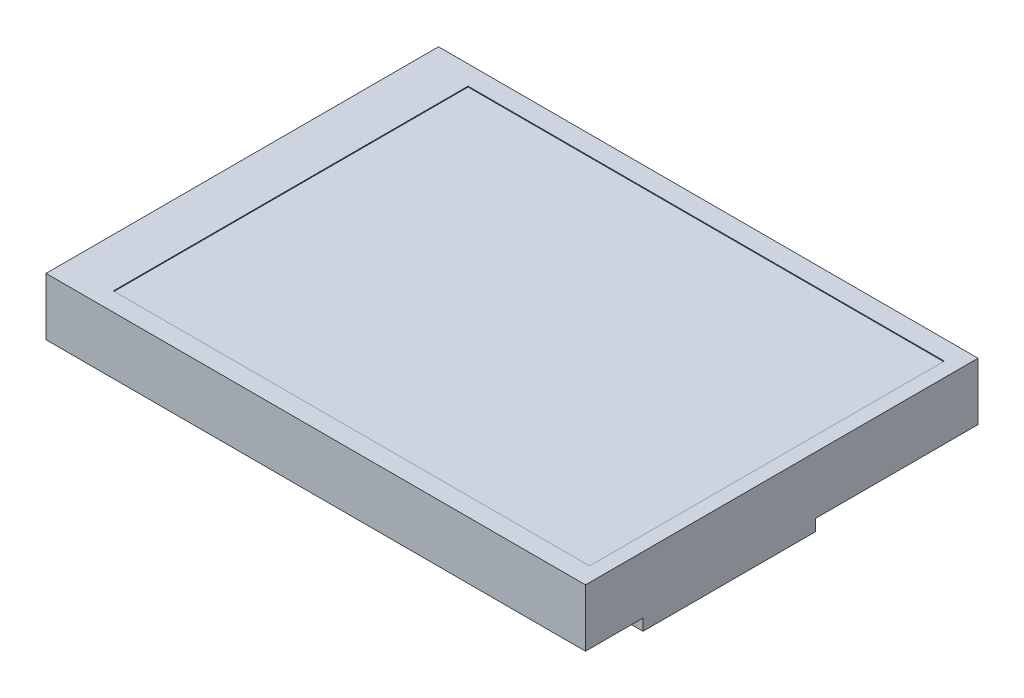
ISO-10303-21;
HEADER;
FILE_DESCRIPTION(('STEP AP214'),'2;1');
FILE_NAME('part.step','',(''),(''),'','','');
FILE_SCHEMA(('AUTOMOTIVE_DESIGN { 1 0 10303 214 1 1 1 1 }'));
ENDSEC;
DATA;
#1=APPLICATION_CONTEXT('core data for automotive mechanical design processes');
#2=APPLICATION_PROTOCOL_DEFINITION('international standard','automotive_design',2000,#1);
#3=PRODUCT_CONTEXT('',#1,'mechanical');
#4=PRODUCT('Part','Part','',(#3));
#5=PRODUCT_RELATED_PRODUCT_CATEGORY('part','',(#4));
#6=PRODUCT_DEFINITION_FORMATION('','',#4);
#7=PRODUCT_DEFINITION_CONTEXT('part definition',#1,'design');
#8=PRODUCT_DEFINITION('design','',#6,#7);
#9=PRODUCT_DEFINITION_SHAPE('','',#8);
#10=(LENGTH_UNIT() NAMED_UNIT(*) SI_UNIT(.MILLI.,.METRE.));
#11=(NAMED_UNIT(*) PLANE_ANGLE_UNIT() SI_UNIT($,.RADIAN.));
#12=(NAMED_UNIT(*) SI_UNIT($,.STERADIAN.) SOLID_ANGLE_UNIT());
#13=UNCERTAINTY_MEASURE_WITH_UNIT(LENGTH_MEASURE(1.E-05),#10,'distance_accuracy_value','');
#14=(GEOMETRIC_REPRESENTATION_CONTEXT(3) GLOBAL_UNCERTAINTY_ASSIGNED_CONTEXT((#13)) GLOBAL_UNIT_ASSIGNED_CONTEXT((#10,
#11,#12)) REPRESENTATION_CONTEXT('',''));
#15=CARTESIAN_POINT('',(0.,0.,0.));
#16=DIRECTION('',(0.,0.,1.));
#17=DIRECTION('',(1.,0.,0.));
#18=AXIS2_PLACEMENT_3D('',#15,#16,#17);
#19=CARTESIAN_POINT('',(0.,0.,0.));
#20=DIRECTION('',(0.,-1.,0.));
#21=DIRECTION('',(0.,0.,-1.));
#22=AXIS2_PLACEMENT_3D('',#19,#20,#21);
#23=PLANE('',#22);
#24=DIRECTION('',(-1.,0.,0.));
#25=VECTOR('',#24,1.);
#26=CARTESIAN_POINT('',(52.7,0.,-7.));
#27=LINE('',#26,#25);
#28=CARTESIAN_POINT('',(65.7,0.,-7.));
#29=VERTEX_POINT('',#28);
#30=CARTESIAN_POINT('',(52.7,0.,-7.));
#31=VERTEX_POINT('',#30);
#32=EDGE_CURVE('E287',#29,#31,#27,.T.);
#33=ORIENTED_EDGE('',*,*,#32,.F.);
#34=DIRECTION('',(0.,0.,-1.));
#35=VECTOR('',#34,1.);
#36=CARTESIAN_POINT('',(65.7,0.,0.));
#37=LINE('',#36,#35);
#38=CARTESIAN_POINT('',(65.7,0.,0.));
#39=VERTEX_POINT('',#38);
#40=EDGE_CURVE('E361',#39,#29,#37,.T.);
#41=ORIENTED_EDGE('',*,*,#40,.F.);
#42=DIRECTION('',(1.,0.,0.));
#43=VECTOR('',#42,1.);
#44=CARTESIAN_POINT('',(0.,0.,0.));
#45=LINE('',#44,#43);
#46=CARTESIAN_POINT('',(0.,0.,0.));
#47=VERTEX_POINT('',#46);
#48=EDGE_CURVE('E358',#47,#39,#45,.T.);
#49=ORIENTED_EDGE('',*,*,#48,.F.);
#50=DIRECTION('',(0.,0.,1.));
#51=VECTOR('',#50,1.);
#52=CARTESIAN_POINT('',(0.,0.,0.));
#53=LINE('',#52,#51);
#54=CARTESIAN_POINT('',(0.,0.,-47.8));
#55=VERTEX_POINT('',#54);
#56=EDGE_CURVE('E338',#55,#47,#53,.T.);
#57=ORIENTED_EDGE('',*,*,#56,.F.);
#58=DIRECTION('',(-1.,0.,0.));
#59=VECTOR('',#58,1.);
#60=CARTESIAN_POINT('',(0.,0.,-47.8));
#61=LINE('',#60,#59);
#62=CARTESIAN_POINT('',(65.7,0.,-47.8));
#63=VERTEX_POINT('',#62);
#64=EDGE_CURVE('E349',#63,#55,#61,.T.);
#65=ORIENTED_EDGE('',*,*,#64,.F.);
#66=CARTESIAN_POINT('',(65.7,0.,-28.));
#67=VERTEX_POINT('',#66);
#68=EDGE_CURVE('E360',#67,#63,#37,.T.);
#69=ORIENTED_EDGE('',*,*,#68,.F.);
#70=DIRECTION('',(1.,0.,0.));
#71=VECTOR('',#70,1.);
#72=CARTESIAN_POINT('',(52.7,0.,-28.));
#73=LINE('',#72,#71);
#74=CARTESIAN_POINT('',(52.7,0.,-28.));
#75=VERTEX_POINT('',#74);
#76=EDGE_CURVE('E296',#75,#67,#73,.T.);
#77=ORIENTED_EDGE('',*,*,#76,.F.);
#78=DIRECTION('',(0.,0.,-1.));
#79=VECTOR('',#78,1.);
#80=CARTESIAN_POINT('',(52.7,0.,-7.));
#81=LINE('',#80,#79);
#82=EDGE_CURVE('E282',#31,#75,#81,.T.);
#83=ORIENTED_EDGE('',*,*,#82,.F.);
#84=EDGE_LOOP('',(#33,#41,#49,#57,#65,#69,#77,#83));
#85=FACE_BOUND('',#84,.T.);
#86=DIRECTION('',(1.,0.,0.));
#87=VECTOR('',#86,1.);
#88=CARTESIAN_POINT('',(25.,0.,-12.));
#89=LINE('',#88,#87);
#90=CARTESIAN_POINT('',(25.,0.,-12.));
#91=VERTEX_POINT('',#90);
#92=CARTESIAN_POINT('',(30.5,0.,-12.));
#93=VERTEX_POINT('',#92);
#94=EDGE_CURVE('E267',#91,#93,#89,.T.);
#95=ORIENTED_EDGE('',*,*,#94,.F.);
#96=DIRECTION('',(0.,0.,-1.));
#97=VECTOR('',#96,1.);
#98=CARTESIAN_POINT('',(25.,0.,-3.5));
#99=LINE('',#98,#97);
#100=CARTESIAN_POINT('',(25.,0.,-3.5));
#101=VERTEX_POINT('',#100);
#102=EDGE_CURVE('E253',#101,#91,#99,.T.);
#103=ORIENTED_EDGE('',*,*,#102,.F.);
#104=DIRECTION('',(-1.,0.,0.));
#105=VECTOR('',#104,1.);
#106=CARTESIAN_POINT('',(25.,0.,-3.5));
#107=LINE('',#106,#105);
#108=CARTESIAN_POINT('',(30.5,0.,-3.5));
#109=VERTEX_POINT('',#108);
#110=EDGE_CURVE('E258',#109,#101,#107,.T.);
#111=ORIENTED_EDGE('',*,*,#110,.F.);
#112=DIRECTION('',(0.,0.,1.));
#113=VECTOR('',#112,1.);
#114=CARTESIAN_POINT('',(30.5,0.,-3.5));
#115=LINE('',#114,#113);
#116=EDGE_CURVE('E269',#93,#109,#115,.T.);
#117=ORIENTED_EDGE('',*,*,#116,.F.);
#118=EDGE_LOOP('',(#95,#103,#111,#117));
#119=FACE_BOUND('',#118,.T.);
#120=DIRECTION('',(-1.,0.,0.));
#121=VECTOR('',#120,1.);
#122=CARTESIAN_POINT('',(29.7,0.,-16.));
#123=LINE('',#122,#121);
#124=CARTESIAN_POINT('',(29.7,0.,-16.));
#125=VERTEX_POINT('',#124);
#126=CARTESIAN_POINT('',(25.7,0.,-16.));
#127=VERTEX_POINT('',#126);
#128=EDGE_CURVE('E225',#125,#127,#123,.T.);
#129=ORIENTED_EDGE('',*,*,#128,.F.);
#130=DIRECTION('',(0.,0.,1.));
#131=VECTOR('',#130,1.);
#132=CARTESIAN_POINT('',(29.7,0.,-16.));
#133=LINE('',#132,#131);
#134=CARTESIAN_POINT('',(29.7,0.,-31.));
#135=VERTEX_POINT('',#134);
#136=EDGE_CURVE('E222',#135,#125,#133,.T.);
#137=ORIENTED_EDGE('',*,*,#136,.F.);
#138=DIRECTION('',(1.,0.,0.));
#139=VECTOR('',#138,1.);
#140=CARTESIAN_POINT('',(29.7,0.,-31.));
#141=LINE('',#140,#139);
#142=CARTESIAN_POINT('',(25.7,0.,-31.));
#143=VERTEX_POINT('',#142);
#144=EDGE_CURVE('E234',#143,#135,#141,.T.);
#145=ORIENTED_EDGE('',*,*,#144,.F.);
#146=DIRECTION('',(0.,0.,-1.));
#147=VECTOR('',#146,1.);
#148=CARTESIAN_POINT('',(25.7,0.,-16.));
#149=LINE('',#148,#147);
#150=EDGE_CURVE('E242',#127,#143,#149,.T.);
#151=ORIENTED_EDGE('',*,*,#150,.F.);
#152=EDGE_LOOP('',(#129,#137,#145,#151));
#153=FACE_BOUND('',#152,.T.);
#154=DIRECTION('',(1.,0.,0.));
#155=VECTOR('',#154,1.);
#156=CARTESIAN_POINT('',(7.70000000000001,0.,-46.3));
#157=LINE('',#156,#155);
#158=CARTESIAN_POINT('',(7.70000000000001,0.,-46.3));
#159=VERTEX_POINT('',#158);
#160=CARTESIAN_POINT('',(58.7,0.,-46.3));
#161=VERTEX_POINT('',#160);
#162=EDGE_CURVE('E665',#159,#161,#157,.T.);
#163=ORIENTED_EDGE('',*,*,#162,.F.);
#164=DIRECTION('',(0.,0.,-1.));
#165=VECTOR('',#164,1.);
#166=CARTESIAN_POINT('',(7.70000000000001,0.,-41.3));
#167=LINE('',#166,#165);
#168=CARTESIAN_POINT('',(7.70000000000001,0.,-41.3));
#169=VERTEX_POINT('',#168);
#170=EDGE_CURVE('E220',#169,#159,#167,.T.);
#171=ORIENTED_EDGE('',*,*,#170,.F.);
#172=DIRECTION('',(-1.,0.,0.));
#173=VECTOR('',#172,1.);
#174=CARTESIAN_POINT('',(7.70000000000001,0.,-41.3));
#175=LINE('',#174,#173);
#176=CARTESIAN_POINT('',(58.7,0.,-41.3));
#177=VERTEX_POINT('',#176);
#178=EDGE_CURVE('E216',#177,#169,#175,.T.);
#179=ORIENTED_EDGE('',*,*,#178,.F.);
#180=DIRECTION('',(0.,0.,1.));
#181=VECTOR('',#180,1.);
#182=CARTESIAN_POINT('',(58.7,0.,-41.3));
#183=LINE('',#182,#181);
#184=EDGE_CURVE('E662',#161,#177,#183,.T.);
#185=ORIENTED_EDGE('',*,*,#184,.F.);
#186=EDGE_LOOP('',(#163,#171,#179,#185));
#187=FACE_BOUND('',#186,.T.);
#188=ADVANCED_FACE('F35',(#85,#119,#153,#187),#23,.T.);
#189=CARTESIAN_POINT('',(0.,7.,0.));
#190=DIRECTION('',(1.,0.,0.));
#191=DIRECTION('',(0.,0.,-1.));
#192=AXIS2_PLACEMENT_3D('',#189,#190,#191);
#193=PLANE('',#192);
#194=ORIENTED_EDGE('',*,*,#56,.T.);
#195=DIRECTION('',(0.,-1.,0.));
#196=VECTOR('',#195,1.);
#197=CARTESIAN_POINT('',(0.,7.,0.));
#198=LINE('',#197,#196);
#199=CARTESIAN_POINT('',(0.,7.,0.));
#200=VERTEX_POINT('',#199);
#201=EDGE_CURVE('E11',#200,#47,#198,.T.);
#202=ORIENTED_EDGE('',*,*,#201,.F.);
#203=DIRECTION('',(0.,0.,1.));
#204=VECTOR('',#203,1.);
#205=CARTESIAN_POINT('',(0.,7.,0.));
#206=LINE('',#205,#204);
#207=CARTESIAN_POINT('',(0.,7.,-47.8));
#208=VERTEX_POINT('',#207);
#209=EDGE_CURVE('E345',#208,#200,#206,.T.);
#210=ORIENTED_EDGE('',*,*,#209,.F.);
#211=DIRECTION('',(0.,-1.,0.));
#212=VECTOR('',#211,1.);
#213=CARTESIAN_POINT('',(0.,7.,-47.8));
#214=LINE('',#213,#212);
#215=EDGE_CURVE('E355',#208,#55,#214,.T.);
#216=ORIENTED_EDGE('',*,*,#215,.T.);
#217=EDGE_LOOP('',(#194,#202,#210,#216));
#218=FACE_BOUND('',#217,.T.);
#219=ADVANCED_FACE('F37',(#218),#193,.F.);
#220=CARTESIAN_POINT('',(0.,7.,0.));
#221=DIRECTION('',(0.,0.,-1.));
#222=DIRECTION('',(-1.,0.,0.));
#223=AXIS2_PLACEMENT_3D('',#220,#221,#222);
#224=PLANE('',#223);
#225=ORIENTED_EDGE('',*,*,#48,.T.);
#226=DIRECTION('',(0.,-1.,0.));
#227=VECTOR('',#226,1.);
#228=CARTESIAN_POINT('',(65.7,7.,0.));
#229=LINE('',#228,#227);
#230=CARTESIAN_POINT('',(65.7,7.,0.));
#231=VERTEX_POINT('',#230);
#232=EDGE_CURVE('E43',#231,#39,#229,.T.);
#233=ORIENTED_EDGE('',*,*,#232,.F.);
#234=DIRECTION('',(1.,0.,0.));
#235=VECTOR('',#234,1.);
#236=CARTESIAN_POINT('',(0.,7.,0.));
#237=LINE('',#236,#235);
#238=EDGE_CURVE('E348',#200,#231,#237,.T.);
#239=ORIENTED_EDGE('',*,*,#238,.F.);
#240=ORIENTED_EDGE('',*,*,#201,.T.);
#241=EDGE_LOOP('',(#225,#233,#239,#240));
#242=FACE_BOUND('',#241,.T.);
#243=ADVANCED_FACE('F405',(#242),#224,.F.);
#244=CARTESIAN_POINT('',(65.7,7.,0.));
#245=DIRECTION('',(-1.,0.,0.));
#246=DIRECTION('',(0.,0.,1.));
#247=AXIS2_PLACEMENT_3D('',#244,#245,#246);
#248=PLANE('',#247);
#249=ORIENTED_EDGE('',*,*,#40,.T.);
#250=DIRECTION('',(0.,1.,0.));
#251=VECTOR('',#250,1.);
#252=CARTESIAN_POINT('',(65.7,-1.4,-7.));
#253=LINE('',#252,#251);
#254=CARTESIAN_POINT('',(65.7,-1.4,-7.));
#255=VERTEX_POINT('',#254);
#256=EDGE_CURVE('E303',#255,#29,#253,.T.);
#257=ORIENTED_EDGE('',*,*,#256,.F.);
#258=DIRECTION('',(0.,0.,1.));
#259=VECTOR('',#258,1.);
#260=CARTESIAN_POINT('',(65.7,-1.4,-7.));
#261=LINE('',#260,#259);
#262=CARTESIAN_POINT('',(65.7,-1.4,-28.));
#263=VERTEX_POINT('',#262);
#264=EDGE_CURVE('E289',#263,#255,#261,.T.);
#265=ORIENTED_EDGE('',*,*,#264,.F.);
#266=DIRECTION('',(0.,1.,0.));
#267=VECTOR('',#266,1.);
#268=CARTESIAN_POINT('',(65.7,-1.4,-28.));
#269=LINE('',#268,#267);
#270=EDGE_CURVE('E306',#263,#67,#269,.T.);
#271=ORIENTED_EDGE('',*,*,#270,.T.);
#272=ORIENTED_EDGE('',*,*,#68,.T.);
#273=DIRECTION('',(0.,-1.,0.));
#274=VECTOR('',#273,1.);
#275=CARTESIAN_POINT('',(65.7,7.,-47.8));
#276=LINE('',#275,#274);
#277=CARTESIAN_POINT('',(65.7,7.,-47.8));
#278=VERTEX_POINT('',#277);
#279=EDGE_CURVE('E367',#278,#63,#276,.T.);
#280=ORIENTED_EDGE('',*,*,#279,.F.);
#281=DIRECTION('',(0.,0.,-1.));
#282=VECTOR('',#281,1.);
#283=CARTESIAN_POINT('',(65.7,7.,0.));
#284=LINE('',#283,#282);
#285=EDGE_CURVE('E351',#231,#278,#284,.T.);
#286=ORIENTED_EDGE('',*,*,#285,.F.);
#287=ORIENTED_EDGE('',*,*,#232,.T.);
#288=EDGE_LOOP('',(#249,#257,#265,#271,#272,#280,#286,#287));
#289=FACE_BOUND('',#288,.T.);
#290=ADVANCED_FACE('F374',(#289),#248,.F.);
#291=CARTESIAN_POINT('',(0.,7.,-47.8));
#292=DIRECTION('',(0.,0.,1.));
#293=DIRECTION('',(1.,0.,0.));
#294=AXIS2_PLACEMENT_3D('',#291,#292,#293);
#295=PLANE('',#294);
#296=ORIENTED_EDGE('',*,*,#64,.T.);
#297=ORIENTED_EDGE('',*,*,#215,.F.);
#298=DIRECTION('',(-1.,0.,0.));
#299=VECTOR('',#298,1.);
#300=CARTESIAN_POINT('',(0.,7.,-47.8));
#301=LINE('',#300,#299);
#302=EDGE_CURVE('E353',#278,#208,#301,.T.);
#303=ORIENTED_EDGE('',*,*,#302,.F.);
#304=ORIENTED_EDGE('',*,*,#279,.T.);
#305=EDGE_LOOP('',(#296,#297,#303,#304));
#306=FACE_BOUND('',#305,.T.);
#307=ADVANCED_FACE('F398',(#306),#295,.F.);
#308=CARTESIAN_POINT('',(0.,7.,0.));
#309=DIRECTION('',(0.,-1.,0.));
#310=DIRECTION('',(0.,0.,-1.));
#311=AXIS2_PLACEMENT_3D('',#308,#309,#310);
#312=PLANE('',#311);
#313=DIRECTION('',(1.,0.,0.));
#314=VECTOR('',#313,1.);
#315=CARTESIAN_POINT('',(5.95000000000001,7.,-2.25));
#316=LINE('',#315,#314);
#317=CARTESIAN_POINT('',(5.95000000000001,7.,-2.25));
#318=VERTEX_POINT('',#317);
#319=CARTESIAN_POINT('',(63.95,7.,-2.25));
#320=VERTEX_POINT('',#319);
#321=EDGE_CURVE('E328',#318,#320,#316,.T.);
#322=ORIENTED_EDGE('',*,*,#321,.F.);
#323=DIRECTION('',(0.,0.,1.));
#324=VECTOR('',#323,1.);
#325=CARTESIAN_POINT('',(5.95,7.,-45.45));
#326=LINE('',#325,#324);
#327=CARTESIAN_POINT('',(5.95,7.,-45.45));
#328=VERTEX_POINT('',#327);
#329=EDGE_CURVE('E312',#328,#318,#326,.T.);
#330=ORIENTED_EDGE('',*,*,#329,.F.);
#331=DIRECTION('',(-1.,0.,0.));
#332=VECTOR('',#331,1.);
#333=CARTESIAN_POINT('',(5.95,7.,-45.45));
#334=LINE('',#333,#332);
#335=CARTESIAN_POINT('',(63.95,7.,-45.45));
#336=VERTEX_POINT('',#335);
#337=EDGE_CURVE('E317',#336,#328,#334,.T.);
#338=ORIENTED_EDGE('',*,*,#337,.F.);
#339=DIRECTION('',(0.,0.,-1.));
#340=VECTOR('',#339,1.);
#341=CARTESIAN_POINT('',(63.95,7.,-45.45));
#342=LINE('',#341,#340);
#343=EDGE_CURVE('E331',#320,#336,#342,.T.);
#344=ORIENTED_EDGE('',*,*,#343,.F.);
#345=EDGE_LOOP('',(#322,#330,#338,#344));
#346=FACE_BOUND('',#345,.T.);
#347=ORIENTED_EDGE('',*,*,#209,.T.);
#348=ORIENTED_EDGE('',*,*,#238,.T.);
#349=ORIENTED_EDGE('',*,*,#285,.T.);
#350=ORIENTED_EDGE('',*,*,#302,.T.);
#351=EDGE_LOOP('',(#347,#348,#349,#350));
#352=FACE_BOUND('',#351,.T.);
#353=ADVANCED_FACE('F404',(#346,#352),#312,.F.);
#354=CARTESIAN_POINT('',(5.95,6.9,-45.45));
#355=DIRECTION('',(-1.,0.,0.));
#356=DIRECTION('',(0.,0.,1.));
#357=AXIS2_PLACEMENT_3D('',#354,#355,#356);
#358=PLANE('',#357);
#359=ORIENTED_EDGE('',*,*,#329,.T.);
#360=DIRECTION('',(0.,1.,0.));
#361=VECTOR('',#360,1.);
#362=CARTESIAN_POINT('',(5.95000000000001,6.9,-2.25));
#363=LINE('',#362,#361);
#364=CARTESIAN_POINT('',(5.95000000000001,6.9,-2.25));
#365=VERTEX_POINT('',#364);
#366=EDGE_CURVE('E326',#365,#318,#363,.T.);
#367=ORIENTED_EDGE('',*,*,#366,.F.);
#368=DIRECTION('',(0.,0.,1.));
#369=VECTOR('',#368,1.);
#370=CARTESIAN_POINT('',(5.95,6.9,-45.45));
#371=LINE('',#370,#369);
#372=CARTESIAN_POINT('',(5.95,6.9,-45.45));
#373=VERTEX_POINT('',#372);
#374=EDGE_CURVE('E313',#373,#365,#371,.T.);
#375=ORIENTED_EDGE('',*,*,#374,.F.);
#376=DIRECTION('',(0.,1.,0.));
#377=VECTOR('',#376,1.);
#378=CARTESIAN_POINT('',(5.95,6.9,-45.45));
#379=LINE('',#378,#377);
#380=EDGE_CURVE('E336',#373,#328,#379,.T.);
#381=ORIENTED_EDGE('',*,*,#380,.T.);
#382=EDGE_LOOP('',(#359,#367,#375,#381));
#383=FACE_BOUND('',#382,.T.);
#384=ADVANCED_FACE('F423',(#383),#358,.F.);
#385=CARTESIAN_POINT('',(5.95,6.9,-45.45));
#386=DIRECTION('',(0.,0.,-1.));
#387=DIRECTION('',(-1.,0.,0.));
#388=AXIS2_PLACEMENT_3D('',#385,#386,#387);
#389=PLANE('',#388);
#390=ORIENTED_EDGE('',*,*,#337,.T.);
#391=ORIENTED_EDGE('',*,*,#380,.F.);
#392=DIRECTION('',(-1.,0.,0.));
#393=VECTOR('',#392,1.);
#394=CARTESIAN_POINT('',(5.95,6.9,-45.45));
#395=LINE('',#394,#393);
#396=CARTESIAN_POINT('',(63.95,6.9,-45.45));
#397=VERTEX_POINT('',#396);
#398=EDGE_CURVE('E323',#397,#373,#395,.T.);
#399=ORIENTED_EDGE('',*,*,#398,.F.);
#400=DIRECTION('',(0.,1.,0.));
#401=VECTOR('',#400,1.);
#402=CARTESIAN_POINT('',(63.95,6.9,-45.45));
#403=LINE('',#402,#401);
#404=EDGE_CURVE('E339',#397,#336,#403,.T.);
#405=ORIENTED_EDGE('',*,*,#404,.T.);
#406=EDGE_LOOP('',(#390,#391,#399,#405));
#407=FACE_BOUND('',#406,.T.);
#408=ADVANCED_FACE('F428',(#407),#389,.F.);
#409=CARTESIAN_POINT('',(63.95,6.9,-45.45));
#410=DIRECTION('',(1.,0.,0.));
#411=DIRECTION('',(0.,0.,-1.));
#412=AXIS2_PLACEMENT_3D('',#409,#410,#411);
#413=PLANE('',#412);
#414=ORIENTED_EDGE('',*,*,#343,.T.);
#415=ORIENTED_EDGE('',*,*,#404,.F.);
#416=DIRECTION('',(0.,0.,-1.));
#417=VECTOR('',#416,1.);
#418=CARTESIAN_POINT('',(63.95,6.9,-45.45));
#419=LINE('',#418,#417);
#420=CARTESIAN_POINT('',(63.95,6.9,-2.25));
#421=VERTEX_POINT('',#420);
#422=EDGE_CURVE('E320',#421,#397,#419,.T.);
#423=ORIENTED_EDGE('',*,*,#422,.F.);
#424=DIRECTION('',(0.,1.,0.));
#425=VECTOR('',#424,1.);
#426=CARTESIAN_POINT('',(63.95,6.9,-2.25));
#427=LINE('',#426,#425);
#428=EDGE_CURVE('E341',#421,#320,#427,.T.);
#429=ORIENTED_EDGE('',*,*,#428,.T.);
#430=EDGE_LOOP('',(#414,#415,#423,#429));
#431=FACE_BOUND('',#430,.T.);
#432=ADVANCED_FACE('F442',(#431),#413,.F.);
#433=CARTESIAN_POINT('',(5.95000000000001,6.9,-2.25));
#434=DIRECTION('',(0.,0.,1.));
#435=DIRECTION('',(1.,0.,0.));
#436=AXIS2_PLACEMENT_3D('',#433,#434,#435);
#437=PLANE('',#436);
#438=ORIENTED_EDGE('',*,*,#321,.T.);
#439=ORIENTED_EDGE('',*,*,#428,.F.);
#440=DIRECTION('',(1.,0.,0.));
#441=VECTOR('',#440,1.);
#442=CARTESIAN_POINT('',(5.95000000000001,6.9,-2.25));
#443=LINE('',#442,#441);
#444=EDGE_CURVE('E316',#365,#421,#443,.T.);
#445=ORIENTED_EDGE('',*,*,#444,.F.);
#446=ORIENTED_EDGE('',*,*,#366,.T.);
#447=EDGE_LOOP('',(#438,#439,#445,#446));
#448=FACE_BOUND('',#447,.T.);
#449=ADVANCED_FACE('F435',(#448),#437,.F.);
#450=CARTESIAN_POINT('',(0.,6.9,0.));
#451=DIRECTION('',(0.,1.,0.));
#452=DIRECTION('',(0.,0.,1.));
#453=AXIS2_PLACEMENT_3D('',#450,#451,#452);
#454=PLANE('',#453);
#455=ORIENTED_EDGE('',*,*,#374,.T.);
#456=ORIENTED_EDGE('',*,*,#444,.T.);
#457=ORIENTED_EDGE('',*,*,#422,.T.);
#458=ORIENTED_EDGE('',*,*,#398,.T.);
#459=EDGE_LOOP('',(#455,#456,#457,#458));
#460=FACE_BOUND('',#459,.T.);
#461=ADVANCED_FACE('F444',(#460),#454,.T.);
#462=CARTESIAN_POINT('',(52.7,-1.4,-7.));
#463=DIRECTION('',(1.,0.,0.));
#464=DIRECTION('',(0.,0.,-1.));
#465=AXIS2_PLACEMENT_3D('',#462,#463,#464);
#466=PLANE('',#465);
#467=ORIENTED_EDGE('',*,*,#82,.T.);
#468=DIRECTION('',(0.,1.,0.));
#469=VECTOR('',#468,1.);
#470=CARTESIAN_POINT('',(52.7,-1.4,-28.));
#471=LINE('',#470,#469);
#472=CARTESIAN_POINT('',(52.7,-1.4,-28.));
#473=VERTEX_POINT('',#472);
#474=EDGE_CURVE('E309',#473,#75,#471,.T.);
#475=ORIENTED_EDGE('',*,*,#474,.F.);
#476=DIRECTION('',(0.,0.,-1.));
#477=VECTOR('',#476,1.);
#478=CARTESIAN_POINT('',(52.7,-1.4,-7.));
#479=LINE('',#478,#477);
#480=CARTESIAN_POINT('',(52.7,-1.4,-7.));
#481=VERTEX_POINT('',#480);
#482=EDGE_CURVE('E283',#481,#473,#479,.T.);
#483=ORIENTED_EDGE('',*,*,#482,.F.);
#484=DIRECTION('',(0.,1.,0.));
#485=VECTOR('',#484,1.);
#486=CARTESIAN_POINT('',(52.7,-1.4,-7.));
#487=LINE('',#486,#485);
#488=EDGE_CURVE('E293',#481,#31,#487,.T.);
#489=ORIENTED_EDGE('',*,*,#488,.T.);
#490=EDGE_LOOP('',(#467,#475,#483,#489));
#491=FACE_BOUND('',#490,.T.);
#492=ADVANCED_FACE('F387',(#491),#466,.F.);
#493=CARTESIAN_POINT('',(52.7,-1.4,-28.));
#494=DIRECTION('',(0.,0.,1.));
#495=DIRECTION('',(1.,0.,0.));
#496=AXIS2_PLACEMENT_3D('',#493,#494,#495);
#497=PLANE('',#496);
#498=ORIENTED_EDGE('',*,*,#76,.T.);
#499=ORIENTED_EDGE('',*,*,#270,.F.);
#500=DIRECTION('',(1.,0.,0.));
#501=VECTOR('',#500,1.);
#502=CARTESIAN_POINT('',(52.7,-1.4,-28.));
#503=LINE('',#502,#501);
#504=EDGE_CURVE('E286',#473,#263,#503,.T.);
#505=ORIENTED_EDGE('',*,*,#504,.F.);
#506=ORIENTED_EDGE('',*,*,#474,.T.);
#507=EDGE_LOOP('',(#498,#499,#505,#506));
#508=FACE_BOUND('',#507,.T.);
#509=ADVANCED_FACE('F394',(#508),#497,.F.);
#510=CARTESIAN_POINT('',(52.7,-1.4,-7.));
#511=DIRECTION('',(0.,0.,-1.));
#512=DIRECTION('',(-1.,0.,0.));
#513=AXIS2_PLACEMENT_3D('',#510,#511,#512);
#514=PLANE('',#513);
#515=ORIENTED_EDGE('',*,*,#32,.T.);
#516=ORIENTED_EDGE('',*,*,#488,.F.);
#517=DIRECTION('',(-1.,0.,0.));
#518=VECTOR('',#517,1.);
#519=CARTESIAN_POINT('',(52.7,-1.4,-7.));
#520=LINE('',#519,#518);
#521=EDGE_CURVE('E291',#255,#481,#520,.T.);
#522=ORIENTED_EDGE('',*,*,#521,.F.);
#523=ORIENTED_EDGE('',*,*,#256,.T.);
#524=EDGE_LOOP('',(#515,#516,#522,#523));
#525=FACE_BOUND('',#524,.T.);
#526=ADVANCED_FACE('F383',(#525),#514,.F.);
#527=CARTESIAN_POINT('',(0.,-1.4,0.));
#528=DIRECTION('',(0.,-1.,0.));
#529=DIRECTION('',(0.,0.,-1.));
#530=AXIS2_PLACEMENT_3D('',#527,#528,#529);
#531=PLANE('',#530);
#532=ORIENTED_EDGE('',*,*,#482,.T.);
#533=ORIENTED_EDGE('',*,*,#504,.T.);
#534=ORIENTED_EDGE('',*,*,#264,.T.);
#535=ORIENTED_EDGE('',*,*,#521,.T.);
#536=EDGE_LOOP('',(#532,#533,#534,#535));
#537=FACE_BOUND('',#536,.T.);
#538=ADVANCED_FACE('F390',(#537),#531,.T.);
#539=CARTESIAN_POINT('',(25.,-2.1,-3.5));
#540=DIRECTION('',(1.,0.,0.));
#541=DIRECTION('',(0.,0.,-1.));
#542=AXIS2_PLACEMENT_3D('',#539,#540,#541);
#543=PLANE('',#542);
#544=ORIENTED_EDGE('',*,*,#102,.T.);
#545=DIRECTION('',(0.,1.,0.));
#546=VECTOR('',#545,1.);
#547=CARTESIAN_POINT('',(25.,-2.1,-12.));
#548=LINE('',#547,#546);
#549=CARTESIAN_POINT('',(25.,-2.1,-12.));
#550=VERTEX_POINT('',#549);
#551=EDGE_CURVE('E280',#550,#91,#548,.T.);
#552=ORIENTED_EDGE('',*,*,#551,.F.);
#553=DIRECTION('',(0.,0.,-1.));
#554=VECTOR('',#553,1.);
#555=CARTESIAN_POINT('',(25.,-2.1,-3.5));
#556=LINE('',#555,#554);
#557=CARTESIAN_POINT('',(25.,-2.1,-3.5));
#558=VERTEX_POINT('',#557);
#559=EDGE_CURVE('E254',#558,#550,#556,.T.);
#560=ORIENTED_EDGE('',*,*,#559,.F.);
#561=DIRECTION('',(0.,1.,0.));
#562=VECTOR('',#561,1.);
#563=CARTESIAN_POINT('',(25.,-2.1,-3.5));
#564=LINE('',#563,#562);
#565=EDGE_CURVE('E264',#558,#101,#564,.T.);
#566=ORIENTED_EDGE('',*,*,#565,.T.);
#567=EDGE_LOOP('',(#544,#552,#560,#566));
#568=FACE_BOUND('',#567,.T.);
#569=ADVANCED_FACE('F509',(#568),#543,.F.);
#570=CARTESIAN_POINT('',(25.,-2.1,-12.));
#571=DIRECTION('',(0.,0.,1.));
#572=DIRECTION('',(1.,0.,0.));
#573=AXIS2_PLACEMENT_3D('',#570,#571,#572);
#574=PLANE('',#573);
#575=ORIENTED_EDGE('',*,*,#94,.T.);
#576=DIRECTION('',(0.,1.,0.));
#577=VECTOR('',#576,1.);
#578=CARTESIAN_POINT('',(30.5,-2.1,-12.));
#579=LINE('',#578,#577);
#580=CARTESIAN_POINT('',(30.5,-2.1,-12.));
#581=VERTEX_POINT('',#580);
#582=EDGE_CURVE('E277',#581,#93,#579,.T.);
#583=ORIENTED_EDGE('',*,*,#582,.F.);
#584=DIRECTION('',(1.,0.,0.));
#585=VECTOR('',#584,1.);
#586=CARTESIAN_POINT('',(25.,-2.1,-12.));
#587=LINE('',#586,#585);
#588=EDGE_CURVE('E257',#550,#581,#587,.T.);
#589=ORIENTED_EDGE('',*,*,#588,.F.);
#590=ORIENTED_EDGE('',*,*,#551,.T.);
#591=EDGE_LOOP('',(#575,#583,#589,#590));
#592=FACE_BOUND('',#591,.T.);
#593=ADVANCED_FACE('F518',(#592),#574,.F.);
#594=CARTESIAN_POINT('',(30.5,-2.1,-3.5));
#595=DIRECTION('',(-1.,0.,0.));
#596=DIRECTION('',(0.,0.,1.));
#597=AXIS2_PLACEMENT_3D('',#594,#595,#596);
#598=PLANE('',#597);
#599=ORIENTED_EDGE('',*,*,#116,.T.);
#600=DIRECTION('',(0.,1.,0.));
#601=VECTOR('',#600,1.);
#602=CARTESIAN_POINT('',(30.5,-2.1,-3.5));
#603=LINE('',#602,#601);
#604=CARTESIAN_POINT('',(30.5,-2.1,-3.5));
#605=VERTEX_POINT('',#604);
#606=EDGE_CURVE('E275',#605,#109,#603,.T.);
#607=ORIENTED_EDGE('',*,*,#606,.F.);
#608=DIRECTION('',(0.,0.,1.));
#609=VECTOR('',#608,1.);
#610=CARTESIAN_POINT('',(30.5,-2.1,-3.5));
#611=LINE('',#610,#609);
#612=EDGE_CURVE('E260',#581,#605,#611,.T.);
#613=ORIENTED_EDGE('',*,*,#612,.F.);
#614=ORIENTED_EDGE('',*,*,#582,.T.);
#615=EDGE_LOOP('',(#599,#607,#613,#614));
#616=FACE_BOUND('',#615,.T.);
#617=ADVANCED_FACE('F528',(#616),#598,.F.);
#618=CARTESIAN_POINT('',(25.,-2.1,-3.5));
#619=DIRECTION('',(0.,0.,-1.));
#620=DIRECTION('',(-1.,0.,0.));
#621=AXIS2_PLACEMENT_3D('',#618,#619,#620);
#622=PLANE('',#621);
#623=ORIENTED_EDGE('',*,*,#110,.T.);
#624=ORIENTED_EDGE('',*,*,#565,.F.);
#625=DIRECTION('',(-1.,0.,0.));
#626=VECTOR('',#625,1.);
#627=CARTESIAN_POINT('',(25.,-2.1,-3.5));
#628=LINE('',#627,#626);
#629=EDGE_CURVE('E262',#605,#558,#628,.T.);
#630=ORIENTED_EDGE('',*,*,#629,.F.);
#631=ORIENTED_EDGE('',*,*,#606,.T.);
#632=EDGE_LOOP('',(#623,#624,#630,#631));
#633=FACE_BOUND('',#632,.T.);
#634=ADVANCED_FACE('F538',(#633),#622,.F.);
#635=CARTESIAN_POINT('',(0.,-2.1,0.));
#636=DIRECTION('',(0.,-1.,0.));
#637=DIRECTION('',(0.,0.,-1.));
#638=AXIS2_PLACEMENT_3D('',#635,#636,#637);
#639=PLANE('',#638);
#640=ORIENTED_EDGE('',*,*,#559,.T.);
#641=ORIENTED_EDGE('',*,*,#588,.T.);
#642=ORIENTED_EDGE('',*,*,#612,.T.);
#643=ORIENTED_EDGE('',*,*,#629,.T.);
#644=EDGE_LOOP('',(#640,#641,#642,#643));
#645=FACE_BOUND('',#644,.T.);
#646=ADVANCED_FACE('F548',(#645),#639,.T.);
#647=CARTESIAN_POINT('',(29.7,-1.3,-16.));
#648=DIRECTION('',(-1.,0.,0.));
#649=DIRECTION('',(0.,0.,1.));
#650=AXIS2_PLACEMENT_3D('',#647,#648,#649);
#651=PLANE('',#650);
#652=ORIENTED_EDGE('',*,*,#136,.T.);
#653=DIRECTION('',(0.,1.,0.));
#654=VECTOR('',#653,1.);
#655=CARTESIAN_POINT('',(29.7,-1.3,-16.));
#656=LINE('',#655,#654);
#657=CARTESIAN_POINT('',(29.7,-1.3,-16.));
#658=VERTEX_POINT('',#657);
#659=EDGE_CURVE('E251',#658,#125,#656,.T.);
#660=ORIENTED_EDGE('',*,*,#659,.F.);
#661=DIRECTION('',(0.,0.,1.));
#662=VECTOR('',#661,1.);
#663=CARTESIAN_POINT('',(29.7,-1.3,-16.));
#664=LINE('',#663,#662);
#665=CARTESIAN_POINT('',(29.7,-1.3,-31.));
#666=VERTEX_POINT('',#665);
#667=EDGE_CURVE('E230',#666,#658,#664,.T.);
#668=ORIENTED_EDGE('',*,*,#667,.F.);
#669=DIRECTION('',(0.,1.,0.));
#670=VECTOR('',#669,1.);
#671=CARTESIAN_POINT('',(29.7,-1.3,-31.));
#672=LINE('',#671,#670);
#673=EDGE_CURVE('E239',#666,#135,#672,.T.);
#674=ORIENTED_EDGE('',*,*,#673,.T.);
#675=EDGE_LOOP('',(#652,#660,#668,#674));
#676=FACE_BOUND('',#675,.T.);
#677=ADVANCED_FACE('F558',(#676),#651,.F.);
#678=CARTESIAN_POINT('',(29.7,-1.3,-16.));
#679=DIRECTION('',(0.,0.,-1.));
#680=DIRECTION('',(-1.,0.,0.));
#681=AXIS2_PLACEMENT_3D('',#678,#679,#680);
#682=PLANE('',#681);
#683=ORIENTED_EDGE('',*,*,#128,.T.);
#684=DIRECTION('',(0.,1.,0.));
#685=VECTOR('',#684,1.);
#686=CARTESIAN_POINT('',(25.7,-1.3,-16.));
#687=LINE('',#686,#685);
#688=CARTESIAN_POINT('',(25.7,-1.3,-16.));
#689=VERTEX_POINT('',#688);
#690=EDGE_CURVE('E248',#689,#127,#687,.T.);
#691=ORIENTED_EDGE('',*,*,#690,.F.);
#692=DIRECTION('',(-1.,0.,0.));
#693=VECTOR('',#692,1.);
#694=CARTESIAN_POINT('',(29.7,-1.3,-16.));
#695=LINE('',#694,#693);
#696=EDGE_CURVE('E233',#658,#689,#695,.T.);
#697=ORIENTED_EDGE('',*,*,#696,.F.);
#698=ORIENTED_EDGE('',*,*,#659,.T.);
#699=EDGE_LOOP('',(#683,#691,#697,#698));
#700=FACE_BOUND('',#699,.T.);
#701=ADVANCED_FACE('F568',(#700),#682,.F.);
#702=CARTESIAN_POINT('',(25.7,-1.3,-16.));
#703=DIRECTION('',(1.,0.,0.));
#704=DIRECTION('',(0.,0.,-1.));
#705=AXIS2_PLACEMENT_3D('',#702,#703,#704);
#706=PLANE('',#705);
#707=ORIENTED_EDGE('',*,*,#150,.T.);
#708=DIRECTION('',(0.,1.,0.));
#709=VECTOR('',#708,1.);
#710=CARTESIAN_POINT('',(25.7,-1.3,-31.));
#711=LINE('',#710,#709);
#712=CARTESIAN_POINT('',(25.7,-1.3,-31.));
#713=VERTEX_POINT('',#712);
#714=EDGE_CURVE('E58',#713,#143,#711,.T.);
#715=ORIENTED_EDGE('',*,*,#714,.F.);
#716=DIRECTION('',(0.,0.,-1.));
#717=VECTOR('',#716,1.);
#718=CARTESIAN_POINT('',(25.7,-1.3,-16.));
#719=LINE('',#718,#717);
#720=EDGE_CURVE('E236',#689,#713,#719,.T.);
#721=ORIENTED_EDGE('',*,*,#720,.F.);
#722=ORIENTED_EDGE('',*,*,#690,.T.);
#723=EDGE_LOOP('',(#707,#715,#721,#722));
#724=FACE_BOUND('',#723,.T.);
#725=ADVANCED_FACE('F578',(#724),#706,.F.);
#726=CARTESIAN_POINT('',(29.7,-1.3,-31.));
#727=DIRECTION('',(0.,0.,1.));
#728=DIRECTION('',(1.,0.,0.));
#729=AXIS2_PLACEMENT_3D('',#726,#727,#728);
#730=PLANE('',#729);
#731=ORIENTED_EDGE('',*,*,#144,.T.);
#732=ORIENTED_EDGE('',*,*,#673,.F.);
#733=DIRECTION('',(1.,0.,0.));
#734=VECTOR('',#733,1.);
#735=CARTESIAN_POINT('',(29.7,-1.3,-31.));
#736=LINE('',#735,#734);
#737=EDGE_CURVE('E238',#713,#666,#736,.T.);
#738=ORIENTED_EDGE('',*,*,#737,.F.);
#739=ORIENTED_EDGE('',*,*,#714,.T.);
#740=EDGE_LOOP('',(#731,#732,#738,#739));
#741=FACE_BOUND('',#740,.T.);
#742=ADVANCED_FACE('F588',(#741),#730,.F.);
#743=CARTESIAN_POINT('',(0.,-1.3,0.));
#744=DIRECTION('',(0.,1.,0.));
#745=DIRECTION('',(0.,0.,1.));
#746=AXIS2_PLACEMENT_3D('',#743,#744,#745);
#747=PLANE('',#746);
#748=ORIENTED_EDGE('',*,*,#667,.T.);
#749=ORIENTED_EDGE('',*,*,#696,.T.);
#750=ORIENTED_EDGE('',*,*,#720,.T.);
#751=ORIENTED_EDGE('',*,*,#737,.T.);
#752=EDGE_LOOP('',(#748,#749,#750,#751));
#753=FACE_BOUND('',#752,.T.);
#754=ADVANCED_FACE('F598',(#753),#747,.F.);
#755=CARTESIAN_POINT('',(7.70000000000001,-4.,-41.3));
#756=DIRECTION('',(1.,0.,0.));
#757=DIRECTION('',(0.,0.,-1.));
#758=AXIS2_PLACEMENT_3D('',#755,#756,#757);
#759=PLANE('',#758);
#760=ORIENTED_EDGE('',*,*,#170,.T.);
#761=DIRECTION('',(0.,1.,0.));
#762=VECTOR('',#761,1.);
#763=CARTESIAN_POINT('',(7.70000000000001,-4.,-46.3));
#764=LINE('',#763,#762);
#765=CARTESIAN_POINT('',(7.70000000000001,-4.,-46.3));
#766=VERTEX_POINT('',#765);
#767=EDGE_CURVE('E201',#766,#159,#764,.T.);
#768=ORIENTED_EDGE('',*,*,#767,.F.);
#769=DIRECTION('',(0.,0.,-1.));
#770=VECTOR('',#769,1.);
#771=CARTESIAN_POINT('',(7.70000000000001,-4.,-41.3));
#772=LINE('',#771,#770);
#773=CARTESIAN_POINT('',(7.70000000000001,-4.,-41.3));
#774=VERTEX_POINT('',#773);
#775=EDGE_CURVE('E208',#774,#766,#772,.T.);
#776=ORIENTED_EDGE('',*,*,#775,.F.);
#777=DIRECTION('',(0.,1.,0.));
#778=VECTOR('',#777,1.);
#779=CARTESIAN_POINT('',(7.70000000000001,-4.,-41.3));
#780=LINE('',#779,#778);
#781=EDGE_CURVE('E659',#774,#169,#780,.T.);
#782=ORIENTED_EDGE('',*,*,#781,.T.);
#783=EDGE_LOOP('',(#760,#768,#776,#782));
#784=FACE_BOUND('',#783,.T.);
#785=ADVANCED_FACE('F218',(#784),#759,.F.);
#786=CARTESIAN_POINT('',(7.70000000000001,-4.,-46.3));
#787=DIRECTION('',(0.,0.,1.));
#788=DIRECTION('',(1.,0.,0.));
#789=AXIS2_PLACEMENT_3D('',#786,#787,#788);
#790=PLANE('',#789);
#791=ORIENTED_EDGE('',*,*,#162,.T.);
#792=DIRECTION('',(0.,1.,0.));
#793=VECTOR('',#792,1.);
#794=CARTESIAN_POINT('',(58.7,-4.,-46.3));
#795=LINE('',#794,#793);
#796=CARTESIAN_POINT('',(58.7,-4.,-46.3));
#797=VERTEX_POINT('',#796);
#798=EDGE_CURVE('E204',#797,#161,#795,.T.);
#799=ORIENTED_EDGE('',*,*,#798,.F.);
#800=DIRECTION('',(1.,0.,0.));
#801=VECTOR('',#800,1.);
#802=CARTESIAN_POINT('',(7.70000000000001,-4.,-46.3));
#803=LINE('',#802,#801);
#804=EDGE_CURVE('E197',#766,#797,#803,.T.);
#805=ORIENTED_EDGE('',*,*,#804,.F.);
#806=ORIENTED_EDGE('',*,*,#767,.T.);
#807=EDGE_LOOP('',(#791,#799,#805,#806));
#808=FACE_BOUND('',#807,.T.);
#809=ADVANCED_FACE('F199',(#808),#790,.F.);
#810=CARTESIAN_POINT('',(58.7,-4.,-41.3));
#811=DIRECTION('',(-1.,0.,0.));
#812=DIRECTION('',(0.,0.,1.));
#813=AXIS2_PLACEMENT_3D('',#810,#811,#812);
#814=PLANE('',#813);
#815=ORIENTED_EDGE('',*,*,#184,.T.);
#816=DIRECTION('',(0.,1.,0.));
#817=VECTOR('',#816,1.);
#818=CARTESIAN_POINT('',(58.7,-4.,-41.3));
#819=LINE('',#818,#817);
#820=CARTESIAN_POINT('',(58.7,-4.,-41.3));
#821=VERTEX_POINT('',#820);
#822=EDGE_CURVE('E50',#821,#177,#819,.T.);
#823=ORIENTED_EDGE('',*,*,#822,.F.);
#824=DIRECTION('',(0.,0.,1.));
#825=VECTOR('',#824,1.);
#826=CARTESIAN_POINT('',(58.7,-4.,-41.3));
#827=LINE('',#826,#825);
#828=EDGE_CURVE('E207',#797,#821,#827,.T.);
#829=ORIENTED_EDGE('',*,*,#828,.F.);
#830=ORIENTED_EDGE('',*,*,#798,.T.);
#831=EDGE_LOOP('',(#815,#823,#829,#830));
#832=FACE_BOUND('',#831,.T.);
#833=ADVANCED_FACE('F628',(#832),#814,.F.);
#834=CARTESIAN_POINT('',(7.70000000000001,-4.,-41.3));
#835=DIRECTION('',(0.,0.,-1.));
#836=DIRECTION('',(-1.,0.,0.));
#837=AXIS2_PLACEMENT_3D('',#834,#835,#836);
#838=PLANE('',#837);
#839=ORIENTED_EDGE('',*,*,#178,.T.);
#840=ORIENTED_EDGE('',*,*,#781,.F.);
#841=DIRECTION('',(-1.,0.,0.));
#842=VECTOR('',#841,1.);
#843=CARTESIAN_POINT('',(7.70000000000001,-4.,-41.3));
#844=LINE('',#843,#842);
#845=EDGE_CURVE('E212',#821,#774,#844,.T.);
#846=ORIENTED_EDGE('',*,*,#845,.F.);
#847=ORIENTED_EDGE('',*,*,#822,.T.);
#848=EDGE_LOOP('',(#839,#840,#846,#847));
#849=FACE_BOUND('',#848,.T.);
#850=ADVANCED_FACE('F637',(#849),#838,.F.);
#851=CARTESIAN_POINT('',(0.,-4.,0.));
#852=DIRECTION('',(0.,-1.,0.));
#853=DIRECTION('',(0.,0.,-1.));
#854=AXIS2_PLACEMENT_3D('',#851,#852,#853);
#855=PLANE('',#854);
#856=ORIENTED_EDGE('',*,*,#775,.T.);
#857=ORIENTED_EDGE('',*,*,#804,.T.);
#858=ORIENTED_EDGE('',*,*,#828,.T.);
#859=ORIENTED_EDGE('',*,*,#845,.T.);
#860=EDGE_LOOP('',(#856,#857,#858,#859));
#861=FACE_BOUND('',#860,.T.);
#862=ADVANCED_FACE('F211',(#861),#855,.T.);
#863=CLOSED_SHELL('',(#188,#219,#243,#290,#307,#353,#384,#408,#432,#449,#461,#492,#509,#526,
#538,#569,#593,#617,#634,#646,#677,#701,#725,#742,#754,#785,#809,#833,#850,#862));
#864=MANIFOLD_SOLID_BREP('B2',#863);
#865=ADVANCED_BREP_SHAPE_REPRESENTATION('',(#18,#864),#14);
#866=SHAPE_DEFINITION_REPRESENTATION(#9,#865);
ENDSEC;
END-ISO-10303-21;
